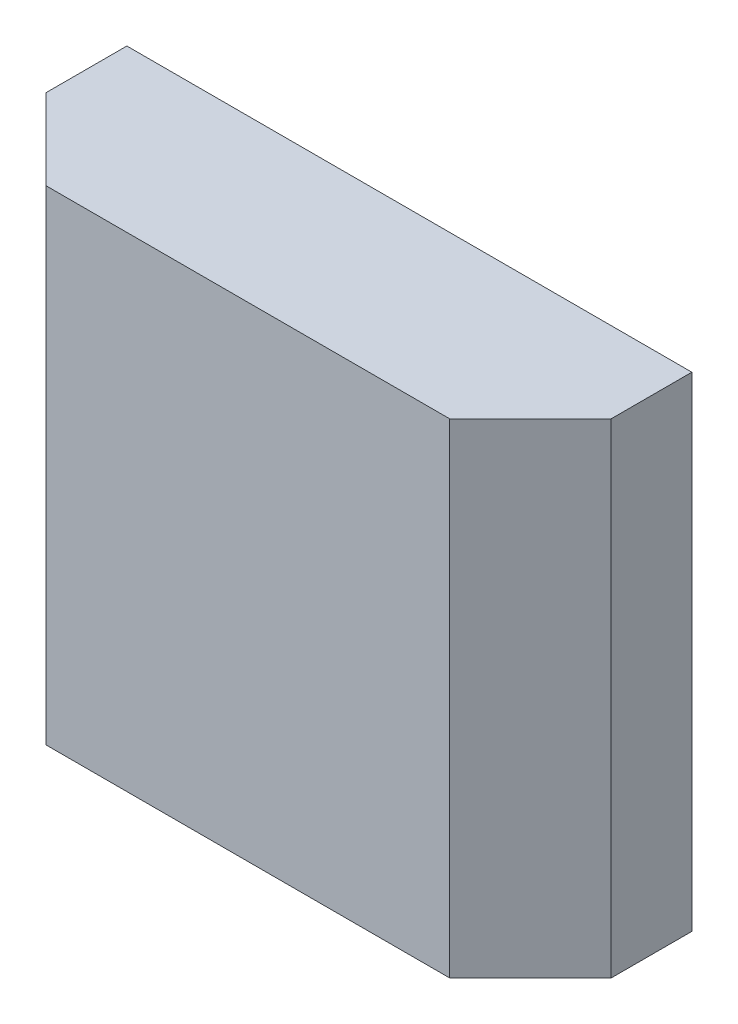
ISO-10303-21;
HEADER;
FILE_DESCRIPTION(('STEP AP214'),'2;1');
FILE_NAME('part.step','',(''),(''),'','','');
FILE_SCHEMA(('AUTOMOTIVE_DESIGN { 1 0 10303 214 1 1 1 1 }'));
ENDSEC;
DATA;
#1=APPLICATION_CONTEXT('core data for automotive mechanical design processes');
#2=APPLICATION_PROTOCOL_DEFINITION('international standard','automotive_design',2000,#1);
#3=PRODUCT_CONTEXT('',#1,'mechanical');
#4=PRODUCT('Part','Part','',(#3));
#5=PRODUCT_RELATED_PRODUCT_CATEGORY('part','',(#4));
#6=PRODUCT_DEFINITION_FORMATION('','',#4);
#7=PRODUCT_DEFINITION_CONTEXT('part definition',#1,'design');
#8=PRODUCT_DEFINITION('design','',#6,#7);
#9=PRODUCT_DEFINITION_SHAPE('','',#8);
#10=(LENGTH_UNIT() NAMED_UNIT(*) SI_UNIT(.MILLI.,.METRE.));
#11=(NAMED_UNIT(*) PLANE_ANGLE_UNIT() SI_UNIT($,.RADIAN.));
#12=(NAMED_UNIT(*) SI_UNIT($,.STERADIAN.) SOLID_ANGLE_UNIT());
#13=UNCERTAINTY_MEASURE_WITH_UNIT(LENGTH_MEASURE(1.E-05),#10,'distance_accuracy_value','');
#14=(GEOMETRIC_REPRESENTATION_CONTEXT(3) GLOBAL_UNCERTAINTY_ASSIGNED_CONTEXT((#13)) GLOBAL_UNIT_ASSIGNED_CONTEXT((#10,
#11,#12)) REPRESENTATION_CONTEXT('',''));
#15=CARTESIAN_POINT('',(0.,0.,0.));
#16=DIRECTION('',(0.,0.,1.));
#17=DIRECTION('',(1.,0.,0.));
#18=AXIS2_PLACEMENT_3D('',#15,#16,#17);
#19=CARTESIAN_POINT('',(-3.5,6.,0.));
#20=DIRECTION('',(1.,0.,0.));
#21=DIRECTION('',(0.,0.,-1.));
#22=AXIS2_PLACEMENT_3D('',#19,#20,#21);
#23=PLANE('',#22);
#24=DIRECTION('',(0.,0.,1.));
#25=VECTOR('',#24,1.);
#26=CARTESIAN_POINT('',(-3.5,0.,0.));
#27=LINE('',#26,#25);
#28=CARTESIAN_POINT('',(-3.5,0.,-1.));
#29=VERTEX_POINT('',#28);
#30=CARTESIAN_POINT('',(-3.5,0.,0.));
#31=VERTEX_POINT('',#30);
#32=EDGE_CURVE('E117',#29,#31,#27,.T.);
#33=ORIENTED_EDGE('',*,*,#32,.T.);
#34=DIRECTION('',(0.,-1.,0.));
#35=VECTOR('',#34,1.);
#36=CARTESIAN_POINT('',(-3.5,6.,0.));
#37=LINE('',#36,#35);
#38=CARTESIAN_POINT('',(-3.5,6.,0.));
#39=VERTEX_POINT('',#38);
#40=EDGE_CURVE('E11',#39,#31,#37,.T.);
#41=ORIENTED_EDGE('',*,*,#40,.F.);
#42=DIRECTION('',(0.,0.,1.));
#43=VECTOR('',#42,1.);
#44=CARTESIAN_POINT('',(-3.5,6.,0.));
#45=LINE('',#44,#43);
#46=CARTESIAN_POINT('',(-3.5,6.,-1.));
#47=VERTEX_POINT('',#46);
#48=EDGE_CURVE('E127',#47,#39,#45,.T.);
#49=ORIENTED_EDGE('',*,*,#48,.F.);
#50=DIRECTION('',(0.,-1.,0.));
#51=VECTOR('',#50,1.);
#52=CARTESIAN_POINT('',(-3.5,6.,-1.));
#53=LINE('',#52,#51);
#54=EDGE_CURVE('E113',#47,#29,#53,.T.);
#55=ORIENTED_EDGE('',*,*,#54,.T.);
#56=EDGE_LOOP('',(#33,#41,#49,#55));
#57=FACE_BOUND('',#56,.T.);
#58=ADVANCED_FACE('F33',(#57),#23,.F.);
#59=CARTESIAN_POINT('',(-2.5,6.,1.));
#60=DIRECTION('',(0.707106781186548,0.,-0.707106781186547));
#61=DIRECTION('',(-0.707106781186547,0.,-0.707106781186548));
#62=AXIS2_PLACEMENT_3D('',#59,#60,#61);
#63=PLANE('',#62);
#64=DIRECTION('',(0.707106781186547,0.,0.707106781186549));
#65=VECTOR('',#64,1.);
#66=CARTESIAN_POINT('',(-2.5,0.,1.));
#67=LINE('',#66,#65);
#68=CARTESIAN_POINT('',(-2.5,0.,1.));
#69=VERTEX_POINT('',#68);
#70=EDGE_CURVE('E120',#31,#69,#67,.T.);
#71=ORIENTED_EDGE('',*,*,#70,.T.);
#72=DIRECTION('',(0.,-1.,0.));
#73=VECTOR('',#72,1.);
#74=CARTESIAN_POINT('',(-2.5,6.,1.));
#75=LINE('',#74,#73);
#76=CARTESIAN_POINT('',(-2.5,6.,1.));
#77=VERTEX_POINT('',#76);
#78=EDGE_CURVE('E41',#77,#69,#75,.T.);
#79=ORIENTED_EDGE('',*,*,#78,.F.);
#80=DIRECTION('',(0.707106781186547,0.,0.707106781186549));
#81=VECTOR('',#80,1.);
#82=CARTESIAN_POINT('',(-2.5,6.,1.));
#83=LINE('',#82,#81);
#84=EDGE_CURVE('E86',#39,#77,#83,.T.);
#85=ORIENTED_EDGE('',*,*,#84,.F.);
#86=ORIENTED_EDGE('',*,*,#40,.T.);
#87=EDGE_LOOP('',(#71,#79,#85,#86));
#88=FACE_BOUND('',#87,.T.);
#89=ADVANCED_FACE('F151',(#88),#63,.F.);
#90=CARTESIAN_POINT('',(2.5,6.,1.));
#91=DIRECTION('',(0.,0.,-1.));
#92=DIRECTION('',(-1.,0.,0.));
#93=AXIS2_PLACEMENT_3D('',#90,#91,#92);
#94=PLANE('',#93);
#95=DIRECTION('',(1.,0.,0.));
#96=VECTOR('',#95,1.);
#97=CARTESIAN_POINT('',(2.5,0.,1.));
#98=LINE('',#97,#96);
#99=CARTESIAN_POINT('',(2.5,0.,1.));
#100=VERTEX_POINT('',#99);
#101=EDGE_CURVE('E122',#69,#100,#98,.T.);
#102=ORIENTED_EDGE('',*,*,#101,.T.);
#103=DIRECTION('',(0.,-1.,0.));
#104=VECTOR('',#103,1.);
#105=CARTESIAN_POINT('',(2.5,6.,1.));
#106=LINE('',#105,#104);
#107=CARTESIAN_POINT('',(2.5,6.,1.));
#108=VERTEX_POINT('',#107);
#109=EDGE_CURVE('E108',#108,#100,#106,.T.);
#110=ORIENTED_EDGE('',*,*,#109,.F.);
#111=DIRECTION('',(1.,0.,0.));
#112=VECTOR('',#111,1.);
#113=CARTESIAN_POINT('',(2.5,6.,1.));
#114=LINE('',#113,#112);
#115=EDGE_CURVE('E99',#77,#108,#114,.T.);
#116=ORIENTED_EDGE('',*,*,#115,.F.);
#117=ORIENTED_EDGE('',*,*,#78,.T.);
#118=EDGE_LOOP('',(#102,#110,#116,#117));
#119=FACE_BOUND('',#118,.T.);
#120=ADVANCED_FACE('F133',(#119),#94,.F.);
#121=CARTESIAN_POINT('',(3.5,6.,0.));
#122=DIRECTION('',(-0.707106781186549,0.,-0.707106781186546));
#123=DIRECTION('',(-0.707106781186546,0.,0.707106781186549));
#124=AXIS2_PLACEMENT_3D('',#121,#122,#123);
#125=PLANE('',#124);
#126=DIRECTION('',(0.707106781186546,0.,-0.707106781186549));
#127=VECTOR('',#126,1.);
#128=CARTESIAN_POINT('',(3.5,0.,0.));
#129=LINE('',#128,#127);
#130=CARTESIAN_POINT('',(3.5,0.,0.));
#131=VERTEX_POINT('',#130);
#132=EDGE_CURVE('E107',#100,#131,#129,.T.);
#133=ORIENTED_EDGE('',*,*,#132,.T.);
#134=DIRECTION('',(0.,-1.,0.));
#135=VECTOR('',#134,1.);
#136=CARTESIAN_POINT('',(3.5,6.,0.));
#137=LINE('',#136,#135);
#138=CARTESIAN_POINT('',(3.5,6.,0.));
#139=VERTEX_POINT('',#138);
#140=EDGE_CURVE('E104',#139,#131,#137,.T.);
#141=ORIENTED_EDGE('',*,*,#140,.F.);
#142=DIRECTION('',(0.707106781186546,0.,-0.707106781186549));
#143=VECTOR('',#142,1.);
#144=CARTESIAN_POINT('',(3.5,6.,0.));
#145=LINE('',#144,#143);
#146=EDGE_CURVE('E93',#108,#139,#145,.T.);
#147=ORIENTED_EDGE('',*,*,#146,.F.);
#148=ORIENTED_EDGE('',*,*,#109,.T.);
#149=EDGE_LOOP('',(#133,#141,#147,#148));
#150=FACE_BOUND('',#149,.T.);
#151=ADVANCED_FACE('F105',(#150),#125,.F.);
#152=CARTESIAN_POINT('',(3.5,6.,-1.));
#153=DIRECTION('',(-1.,0.,0.));
#154=DIRECTION('',(0.,0.,1.));
#155=AXIS2_PLACEMENT_3D('',#152,#153,#154);
#156=PLANE('',#155);
#157=DIRECTION('',(0.,0.,-1.));
#158=VECTOR('',#157,1.);
#159=CARTESIAN_POINT('',(3.5,0.,-1.));
#160=LINE('',#159,#158);
#161=CARTESIAN_POINT('',(3.5,0.,-1.));
#162=VERTEX_POINT('',#161);
#163=EDGE_CURVE('E72',#131,#162,#160,.T.);
#164=ORIENTED_EDGE('',*,*,#163,.T.);
#165=DIRECTION('',(0.,-1.,0.));
#166=VECTOR('',#165,1.);
#167=CARTESIAN_POINT('',(3.5,6.,-1.));
#168=LINE('',#167,#166);
#169=CARTESIAN_POINT('',(3.5,6.,-1.));
#170=VERTEX_POINT('',#169);
#171=EDGE_CURVE('E109',#170,#162,#168,.T.);
#172=ORIENTED_EDGE('',*,*,#171,.F.);
#173=DIRECTION('',(0.,0.,-1.));
#174=VECTOR('',#173,1.);
#175=CARTESIAN_POINT('',(3.5,6.,-1.));
#176=LINE('',#175,#174);
#177=EDGE_CURVE('E97',#139,#170,#176,.T.);
#178=ORIENTED_EDGE('',*,*,#177,.F.);
#179=ORIENTED_EDGE('',*,*,#140,.T.);
#180=EDGE_LOOP('',(#164,#172,#178,#179));
#181=FACE_BOUND('',#180,.T.);
#182=ADVANCED_FACE('F111',(#181),#156,.F.);
#183=CARTESIAN_POINT('',(-3.5,6.,-1.));
#184=DIRECTION('',(0.,0.,1.));
#185=DIRECTION('',(1.,0.,0.));
#186=AXIS2_PLACEMENT_3D('',#183,#184,#185);
#187=PLANE('',#186);
#188=DIRECTION('',(-1.,0.,0.));
#189=VECTOR('',#188,1.);
#190=CARTESIAN_POINT('',(-3.5,0.,-1.));
#191=LINE('',#190,#189);
#192=EDGE_CURVE('E78',#162,#29,#191,.T.);
#193=ORIENTED_EDGE('',*,*,#192,.T.);
#194=ORIENTED_EDGE('',*,*,#54,.F.);
#195=DIRECTION('',(-1.,0.,0.));
#196=VECTOR('',#195,1.);
#197=CARTESIAN_POINT('',(-3.5,6.,-1.));
#198=LINE('',#197,#196);
#199=EDGE_CURVE('E49',#170,#47,#198,.T.);
#200=ORIENTED_EDGE('',*,*,#199,.F.);
#201=ORIENTED_EDGE('',*,*,#171,.T.);
#202=EDGE_LOOP('',(#193,#194,#200,#201));
#203=FACE_BOUND('',#202,.T.);
#204=ADVANCED_FACE('F140',(#203),#187,.F.);
#205=CARTESIAN_POINT('',(0.,6.,0.));
#206=DIRECTION('',(0.,-1.,0.));
#207=DIRECTION('',(0.,0.,-1.));
#208=AXIS2_PLACEMENT_3D('',#205,#206,#207);
#209=PLANE('',#208);
#210=ORIENTED_EDGE('',*,*,#48,.T.);
#211=ORIENTED_EDGE('',*,*,#84,.T.);
#212=ORIENTED_EDGE('',*,*,#115,.T.);
#213=ORIENTED_EDGE('',*,*,#146,.T.);
#214=ORIENTED_EDGE('',*,*,#177,.T.);
#215=ORIENTED_EDGE('',*,*,#199,.T.);
#216=EDGE_LOOP('',(#210,#211,#212,#213,#214,#215));
#217=FACE_BOUND('',#216,.T.);
#218=ADVANCED_FACE('F95',(#217),#209,.F.);
#219=CARTESIAN_POINT('',(0.,0.,0.));
#220=DIRECTION('',(0.,-1.,0.));
#221=DIRECTION('',(0.,0.,-1.));
#222=AXIS2_PLACEMENT_3D('',#219,#220,#221);
#223=PLANE('',#222);
#224=ORIENTED_EDGE('',*,*,#32,.F.);
#225=ORIENTED_EDGE('',*,*,#192,.F.);
#226=ORIENTED_EDGE('',*,*,#163,.F.);
#227=ORIENTED_EDGE('',*,*,#132,.F.);
#228=ORIENTED_EDGE('',*,*,#101,.F.);
#229=ORIENTED_EDGE('',*,*,#70,.F.);
#230=EDGE_LOOP('',(#224,#225,#226,#227,#228,#229));
#231=FACE_BOUND('',#230,.T.);
#232=ADVANCED_FACE('F136',(#231),#223,.T.);
#233=CLOSED_SHELL('',(#58,#89,#120,#151,#182,#204,#218,#232));
#234=MANIFOLD_SOLID_BREP('B2',#233);
#235=ADVANCED_BREP_SHAPE_REPRESENTATION('',(#18,#234),#14);
#236=SHAPE_DEFINITION_REPRESENTATION(#9,#235);
ENDSEC;
END-ISO-10303-21;
